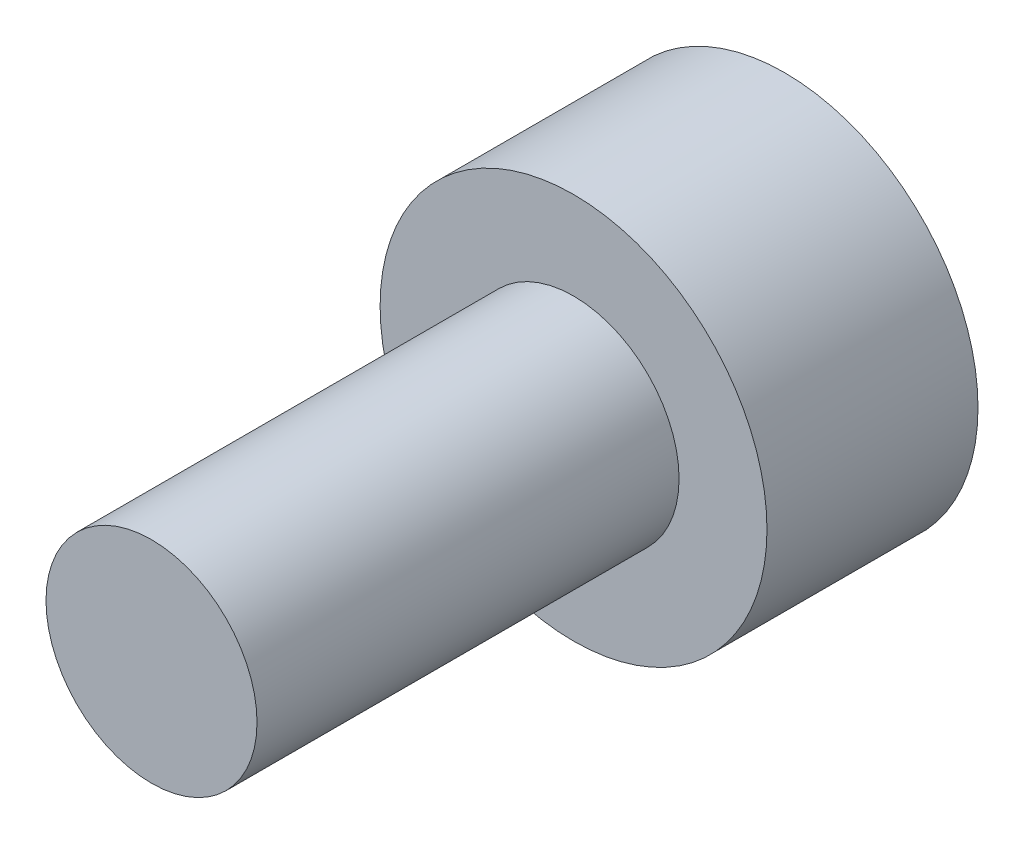
ISO-10303-21;
HEADER;
FILE_DESCRIPTION(('STEP AP214'),'2;1');
FILE_NAME('part.step','',(''),(''),'','','');
FILE_SCHEMA(('AUTOMOTIVE_DESIGN { 1 0 10303 214 1 1 1 1 }'));
ENDSEC;
DATA;
#1=APPLICATION_CONTEXT('core data for automotive mechanical design processes');
#2=APPLICATION_PROTOCOL_DEFINITION('international standard','automotive_design',2000,#1);
#3=PRODUCT_CONTEXT('',#1,'mechanical');
#4=PRODUCT('Part','Part','',(#3));
#5=PRODUCT_RELATED_PRODUCT_CATEGORY('part','',(#4));
#6=PRODUCT_DEFINITION_FORMATION('','',#4);
#7=PRODUCT_DEFINITION_CONTEXT('part definition',#1,'design');
#8=PRODUCT_DEFINITION('design','',#6,#7);
#9=PRODUCT_DEFINITION_SHAPE('','',#8);
#10=(LENGTH_UNIT() NAMED_UNIT(*) SI_UNIT(.MILLI.,.METRE.));
#11=(NAMED_UNIT(*) PLANE_ANGLE_UNIT() SI_UNIT($,.RADIAN.));
#12=(NAMED_UNIT(*) SI_UNIT($,.STERADIAN.) SOLID_ANGLE_UNIT());
#13=UNCERTAINTY_MEASURE_WITH_UNIT(LENGTH_MEASURE(1.E-05),#10,'distance_accuracy_value','');
#14=(GEOMETRIC_REPRESENTATION_CONTEXT(3) GLOBAL_UNCERTAINTY_ASSIGNED_CONTEXT((#13)) GLOBAL_UNIT_ASSIGNED_CONTEXT((#10,
#11,#12)) REPRESENTATION_CONTEXT('',''));
#15=CARTESIAN_POINT('',(0.,0.,0.));
#16=DIRECTION('',(0.,0.,1.));
#17=DIRECTION('',(1.,0.,0.));
#18=AXIS2_PLACEMENT_3D('',#15,#16,#17);
#19=CARTESIAN_POINT('',(0.,0.,0.));
#20=DIRECTION('',(0.,0.,-1.));
#21=DIRECTION('',(-1.,0.,0.));
#22=AXIS2_PLACEMENT_3D('',#19,#20,#21);
#23=PLANE('',#22);
#24=DIRECTION('',(-0.5,0.866025403784439,0.));
#25=VECTOR('',#24,1.);
#26=CARTESIAN_POINT('',(-0.866025403784439,-1.5,0.));
#27=LINE('',#26,#25);
#28=CARTESIAN_POINT('',(-0.866025403784439,-1.5,0.));
#29=VERTEX_POINT('',#28);
#30=CARTESIAN_POINT('',(-1.73205080756888,0.,0.));
#31=VERTEX_POINT('',#30);
#32=EDGE_CURVE('E47',#29,#31,#27,.T.);
#33=ORIENTED_EDGE('',*,*,#32,.F.);
#34=DIRECTION('',(-1.,0.,0.));
#35=VECTOR('',#34,1.);
#36=CARTESIAN_POINT('',(0.866025403784438,-1.5,0.));
#37=LINE('',#36,#35);
#38=CARTESIAN_POINT('',(0.866025403784438,-1.5,0.));
#39=VERTEX_POINT('',#38);
#40=EDGE_CURVE('E130',#39,#29,#37,.T.);
#41=ORIENTED_EDGE('',*,*,#40,.F.);
#42=DIRECTION('',(-0.5,-0.866025403784439,0.));
#43=VECTOR('',#42,1.);
#44=CARTESIAN_POINT('',(1.73205080756888,0.,0.));
#45=LINE('',#44,#43);
#46=CARTESIAN_POINT('',(1.73205080756888,0.,0.));
#47=VERTEX_POINT('',#46);
#48=EDGE_CURVE('E128',#47,#39,#45,.T.);
#49=ORIENTED_EDGE('',*,*,#48,.F.);
#50=DIRECTION('',(0.5,-0.866025403784439,0.));
#51=VECTOR('',#50,1.);
#52=CARTESIAN_POINT('',(0.866025403784439,1.5,0.));
#53=LINE('',#52,#51);
#54=CARTESIAN_POINT('',(0.866025403784439,1.5,0.));
#55=VERTEX_POINT('',#54);
#56=EDGE_CURVE('E95',#55,#47,#53,.T.);
#57=ORIENTED_EDGE('',*,*,#56,.F.);
#58=DIRECTION('',(1.,0.,0.));
#59=VECTOR('',#58,1.);
#60=CARTESIAN_POINT('',(-0.866025403784438,1.5,0.));
#61=LINE('',#60,#59);
#62=CARTESIAN_POINT('',(-0.866025403784438,1.5,0.));
#63=VERTEX_POINT('',#62);
#64=EDGE_CURVE('E124',#63,#55,#61,.T.);
#65=ORIENTED_EDGE('',*,*,#64,.F.);
#66=DIRECTION('',(0.5,0.866025403784438,0.));
#67=VECTOR('',#66,1.);
#68=CARTESIAN_POINT('',(-1.73205080756888,0.,0.));
#69=LINE('',#68,#67);
#70=EDGE_CURVE('E121',#31,#63,#69,.T.);
#71=ORIENTED_EDGE('',*,*,#70,.F.);
#72=EDGE_LOOP('',(#33,#41,#49,#57,#65,#71));
#73=FACE_BOUND('',#72,.T.);
#74=CARTESIAN_POINT('',(0.,0.,0.));
#75=DIRECTION('',(0.,0.,1.));
#76=DIRECTION('',(1.,0.,0.));
#77=AXIS2_PLACEMENT_3D('',#74,#75,#76);
#78=CIRCLE('',#77,2.75);
#79=CARTESIAN_POINT('',(2.75,0.,0.));
#80=VERTEX_POINT('',#79);
#81=EDGE_CURVE('E11',#80,#80,#78,.T.);
#82=ORIENTED_EDGE('',*,*,#81,.F.);
#83=EDGE_LOOP('',(#82));
#84=FACE_BOUND('',#83,.T.);
#85=ADVANCED_FACE('F33',(#73,#84),#23,.T.);
#86=CARTESIAN_POINT('',(0.,0.,3.));
#87=DIRECTION('',(0.,0.,1.));
#88=DIRECTION('',(1.,0.,0.));
#89=AXIS2_PLACEMENT_3D('',#86,#87,#88);
#90=CYLINDRICAL_SURFACE('',#89,2.75);
#91=ORIENTED_EDGE('',*,*,#81,.T.);
#92=EDGE_LOOP('',(#91));
#93=FACE_BOUND('',#92,.T.);
#94=CARTESIAN_POINT('',(0.,0.,3.));
#95=DIRECTION('',(0.,0.,1.));
#96=DIRECTION('',(1.,0.,0.));
#97=AXIS2_PLACEMENT_3D('',#94,#95,#96);
#98=CIRCLE('',#97,2.75);
#99=CARTESIAN_POINT('',(2.75,0.,3.));
#100=VERTEX_POINT('',#99);
#101=EDGE_CURVE('E40',#100,#100,#98,.T.);
#102=ORIENTED_EDGE('',*,*,#101,.F.);
#103=EDGE_LOOP('',(#102));
#104=FACE_BOUND('',#103,.T.);
#105=ADVANCED_FACE('F150',(#93,#104),#90,.T.);
#106=CARTESIAN_POINT('',(2.75,0.,3.));
#107=DIRECTION('',(0.,0.,1.));
#108=DIRECTION('',(1.,0.,0.));
#109=AXIS2_PLACEMENT_3D('',#106,#107,#108);
#110=PLANE('',#109);
#111=ORIENTED_EDGE('',*,*,#101,.T.);
#112=EDGE_LOOP('',(#111));
#113=FACE_BOUND('',#112,.T.);
#114=CARTESIAN_POINT('',(0.,0.,3.));
#115=DIRECTION('',(0.,0.,1.));
#116=DIRECTION('',(1.,0.,0.));
#117=AXIS2_PLACEMENT_3D('',#114,#115,#116);
#118=CIRCLE('',#117,1.5);
#119=CARTESIAN_POINT('',(1.5,0.,3.));
#120=VERTEX_POINT('',#119);
#121=EDGE_CURVE('E142',#120,#120,#118,.T.);
#122=ORIENTED_EDGE('',*,*,#121,.F.);
#123=EDGE_LOOP('',(#122));
#124=FACE_BOUND('',#123,.T.);
#125=ADVANCED_FACE('F147',(#113,#124),#110,.T.);
#126=CARTESIAN_POINT('',(0.,0.,3.));
#127=DIRECTION('',(0.,0.,1.));
#128=DIRECTION('',(1.,0.,0.));
#129=AXIS2_PLACEMENT_3D('',#126,#127,#128);
#130=CYLINDRICAL_SURFACE('',#129,1.5);
#131=ORIENTED_EDGE('',*,*,#121,.T.);
#132=EDGE_LOOP('',(#131));
#133=FACE_BOUND('',#132,.T.);
#134=CARTESIAN_POINT('',(0.,0.,9.));
#135=DIRECTION('',(0.,0.,1.));
#136=DIRECTION('',(1.,0.,0.));
#137=AXIS2_PLACEMENT_3D('',#134,#135,#136);
#138=CIRCLE('',#137,1.5);
#139=CARTESIAN_POINT('',(1.5,0.,9.));
#140=VERTEX_POINT('',#139);
#141=EDGE_CURVE('E134',#140,#140,#138,.T.);
#142=ORIENTED_EDGE('',*,*,#141,.F.);
#143=EDGE_LOOP('',(#142));
#144=FACE_BOUND('',#143,.T.);
#145=ADVANCED_FACE('F157',(#133,#144),#130,.T.);
#146=CARTESIAN_POINT('',(1.5,0.,9.));
#147=DIRECTION('',(0.,0.,1.));
#148=DIRECTION('',(1.,0.,0.));
#149=AXIS2_PLACEMENT_3D('',#146,#147,#148);
#150=PLANE('',#149);
#151=ORIENTED_EDGE('',*,*,#141,.T.);
#152=EDGE_LOOP('',(#151));
#153=FACE_BOUND('',#152,.T.);
#154=ADVANCED_FACE('F163',(#153),#150,.T.);
#155=CARTESIAN_POINT('',(-0.866025403784439,-1.5,1.5));
#156=DIRECTION('',(-0.866025403784439,-0.5,0.));
#157=DIRECTION('',(0.5,-0.866025403784439,0.));
#158=AXIS2_PLACEMENT_3D('',#155,#156,#157);
#159=PLANE('',#158);
#160=ORIENTED_EDGE('',*,*,#32,.T.);
#161=DIRECTION('',(0.,0.,-1.));
#162=VECTOR('',#161,1.);
#163=CARTESIAN_POINT('',(-1.73205080756888,0.,1.5));
#164=LINE('',#163,#162);
#165=CARTESIAN_POINT('',(-1.73205080756888,0.,1.5));
#166=VERTEX_POINT('',#165);
#167=EDGE_CURVE('E77',#166,#31,#164,.T.);
#168=ORIENTED_EDGE('',*,*,#167,.F.);
#169=DIRECTION('',(-0.5,0.866025403784439,0.));
#170=VECTOR('',#169,1.);
#171=CARTESIAN_POINT('',(-0.866025403784439,-1.5,1.5));
#172=LINE('',#171,#170);
#173=CARTESIAN_POINT('',(-0.866025403784439,-1.5,1.5));
#174=VERTEX_POINT('',#173);
#175=EDGE_CURVE('E132',#174,#166,#172,.T.);
#176=ORIENTED_EDGE('',*,*,#175,.F.);
#177=DIRECTION('',(0.,0.,-1.));
#178=VECTOR('',#177,1.);
#179=CARTESIAN_POINT('',(-0.866025403784439,-1.5,1.5));
#180=LINE('',#179,#178);
#181=EDGE_CURVE('E55',#174,#29,#180,.T.);
#182=ORIENTED_EDGE('',*,*,#181,.T.);
#183=EDGE_LOOP('',(#160,#168,#176,#182));
#184=FACE_BOUND('',#183,.T.);
#185=ADVANCED_FACE('F167',(#184),#159,.F.);
#186=CARTESIAN_POINT('',(0.866025403784438,-1.5,1.5));
#187=DIRECTION('',(0.,-1.,0.));
#188=DIRECTION('',(1.,0.,0.));
#189=AXIS2_PLACEMENT_3D('',#186,#187,#188);
#190=PLANE('',#189);
#191=ORIENTED_EDGE('',*,*,#40,.T.);
#192=ORIENTED_EDGE('',*,*,#181,.F.);
#193=DIRECTION('',(-1.,0.,0.));
#194=VECTOR('',#193,1.);
#195=CARTESIAN_POINT('',(0.866025403784438,-1.5,1.5));
#196=LINE('',#195,#194);
#197=CARTESIAN_POINT('',(0.866025403784438,-1.5,1.5));
#198=VERTEX_POINT('',#197);
#199=EDGE_CURVE('E107',#198,#174,#196,.T.);
#200=ORIENTED_EDGE('',*,*,#199,.F.);
#201=DIRECTION('',(0.,0.,-1.));
#202=VECTOR('',#201,1.);
#203=CARTESIAN_POINT('',(0.866025403784438,-1.5,1.5));
#204=LINE('',#203,#202);
#205=EDGE_CURVE('E99',#198,#39,#204,.T.);
#206=ORIENTED_EDGE('',*,*,#205,.T.);
#207=EDGE_LOOP('',(#191,#192,#200,#206));
#208=FACE_BOUND('',#207,.T.);
#209=ADVANCED_FACE('F171',(#208),#190,.F.);
#210=CARTESIAN_POINT('',(1.73205080756888,0.,1.5));
#211=DIRECTION('',(0.866025403784438,-0.5,0.));
#212=DIRECTION('',(0.5,0.866025403784439,0.));
#213=AXIS2_PLACEMENT_3D('',#210,#211,#212);
#214=PLANE('',#213);
#215=ORIENTED_EDGE('',*,*,#48,.T.);
#216=ORIENTED_EDGE('',*,*,#205,.F.);
#217=DIRECTION('',(-0.5,-0.866025403784439,0.));
#218=VECTOR('',#217,1.);
#219=CARTESIAN_POINT('',(1.73205080756888,0.,1.5));
#220=LINE('',#219,#218);
#221=CARTESIAN_POINT('',(1.73205080756888,0.,1.5));
#222=VERTEX_POINT('',#221);
#223=EDGE_CURVE('E103',#222,#198,#220,.T.);
#224=ORIENTED_EDGE('',*,*,#223,.F.);
#225=DIRECTION('',(0.,0.,-1.));
#226=VECTOR('',#225,1.);
#227=CARTESIAN_POINT('',(1.73205080756888,0.,1.5));
#228=LINE('',#227,#226);
#229=EDGE_CURVE('E88',#222,#47,#228,.T.);
#230=ORIENTED_EDGE('',*,*,#229,.T.);
#231=EDGE_LOOP('',(#215,#216,#224,#230));
#232=FACE_BOUND('',#231,.T.);
#233=ADVANCED_FACE('F104',(#232),#214,.F.);
#234=CARTESIAN_POINT('',(0.866025403784439,1.5,1.5));
#235=DIRECTION('',(0.866025403784439,0.5,0.));
#236=DIRECTION('',(-0.5,0.866025403784439,0.));
#237=AXIS2_PLACEMENT_3D('',#234,#235,#236);
#238=PLANE('',#237);
#239=ORIENTED_EDGE('',*,*,#56,.T.);
#240=ORIENTED_EDGE('',*,*,#229,.F.);
#241=DIRECTION('',(0.5,-0.866025403784439,0.));
#242=VECTOR('',#241,1.);
#243=CARTESIAN_POINT('',(0.866025403784439,1.5,1.5));
#244=LINE('',#243,#242);
#245=CARTESIAN_POINT('',(0.866025403784439,1.5,1.5));
#246=VERTEX_POINT('',#245);
#247=EDGE_CURVE('E92',#246,#222,#244,.T.);
#248=ORIENTED_EDGE('',*,*,#247,.F.);
#249=DIRECTION('',(0.,0.,-1.));
#250=VECTOR('',#249,1.);
#251=CARTESIAN_POINT('',(0.866025403784439,1.5,1.5));
#252=LINE('',#251,#250);
#253=EDGE_CURVE('E100',#246,#55,#252,.T.);
#254=ORIENTED_EDGE('',*,*,#253,.T.);
#255=EDGE_LOOP('',(#239,#240,#248,#254));
#256=FACE_BOUND('',#255,.T.);
#257=ADVANCED_FACE('F90',(#256),#238,.F.);
#258=CARTESIAN_POINT('',(-0.866025403784438,1.5,1.5));
#259=DIRECTION('',(0.,1.,0.));
#260=DIRECTION('',(-1.,0.,0.));
#261=AXIS2_PLACEMENT_3D('',#258,#259,#260);
#262=PLANE('',#261);
#263=ORIENTED_EDGE('',*,*,#64,.T.);
#264=ORIENTED_EDGE('',*,*,#253,.F.);
#265=DIRECTION('',(1.,0.,0.));
#266=VECTOR('',#265,1.);
#267=CARTESIAN_POINT('',(-0.866025403784438,1.5,1.5));
#268=LINE('',#267,#266);
#269=CARTESIAN_POINT('',(-0.866025403784438,1.5,1.5));
#270=VERTEX_POINT('',#269);
#271=EDGE_CURVE('E113',#270,#246,#268,.T.);
#272=ORIENTED_EDGE('',*,*,#271,.F.);
#273=DIRECTION('',(0.,0.,-1.));
#274=VECTOR('',#273,1.);
#275=CARTESIAN_POINT('',(-0.866025403784438,1.5,1.5));
#276=LINE('',#275,#274);
#277=EDGE_CURVE('E137',#270,#63,#276,.T.);
#278=ORIENTED_EDGE('',*,*,#277,.T.);
#279=EDGE_LOOP('',(#263,#264,#272,#278));
#280=FACE_BOUND('',#279,.T.);
#281=ADVANCED_FACE('F175',(#280),#262,.F.);
#282=CARTESIAN_POINT('',(-1.73205080756888,0.,1.5));
#283=DIRECTION('',(-0.866025403784439,0.5,0.));
#284=DIRECTION('',(-0.5,-0.866025403784439,0.));
#285=AXIS2_PLACEMENT_3D('',#282,#283,#284);
#286=PLANE('',#285);
#287=ORIENTED_EDGE('',*,*,#70,.T.);
#288=ORIENTED_EDGE('',*,*,#277,.F.);
#289=DIRECTION('',(0.5,0.866025403784438,0.));
#290=VECTOR('',#289,1.);
#291=CARTESIAN_POINT('',(-1.73205080756888,0.,1.5));
#292=LINE('',#291,#290);
#293=EDGE_CURVE('E115',#166,#270,#292,.T.);
#294=ORIENTED_EDGE('',*,*,#293,.F.);
#295=ORIENTED_EDGE('',*,*,#167,.T.);
#296=EDGE_LOOP('',(#287,#288,#294,#295));
#297=FACE_BOUND('',#296,.T.);
#298=ADVANCED_FACE('F172',(#297),#286,.F.);
#299=CARTESIAN_POINT('',(0.,0.,1.5));
#300=DIRECTION('',(0.,0.,-1.));
#301=DIRECTION('',(-1.,0.,0.));
#302=AXIS2_PLACEMENT_3D('',#299,#300,#301);
#303=PLANE('',#302);
#304=ORIENTED_EDGE('',*,*,#175,.T.);
#305=ORIENTED_EDGE('',*,*,#293,.T.);
#306=ORIENTED_EDGE('',*,*,#271,.T.);
#307=ORIENTED_EDGE('',*,*,#247,.T.);
#308=ORIENTED_EDGE('',*,*,#223,.T.);
#309=ORIENTED_EDGE('',*,*,#199,.T.);
#310=EDGE_LOOP('',(#304,#305,#306,#307,#308,#309));
#311=FACE_BOUND('',#310,.T.);
#312=ADVANCED_FACE('F110',(#311),#303,.T.);
#313=CLOSED_SHELL('',(#85,#105,#125,#145,#154,#185,#209,#233,#257,#281,#298,#312));
#314=MANIFOLD_SOLID_BREP('B2',#313);
#315=ADVANCED_BREP_SHAPE_REPRESENTATION('',(#18,#314),#14);
#316=SHAPE_DEFINITION_REPRESENTATION(#9,#315);
ENDSEC;
END-ISO-10303-21;
